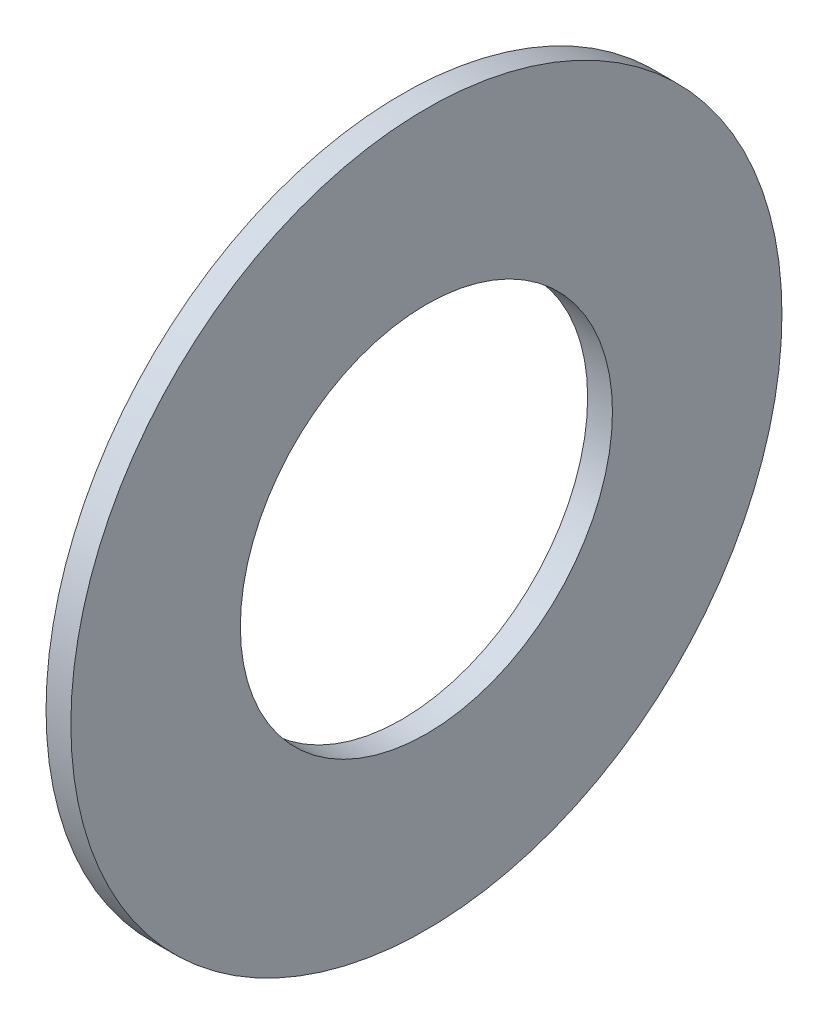
ISO-10303-21;
HEADER;
FILE_DESCRIPTION(('STEP AP214'),'2;1');
FILE_NAME('part.step','',(''),(''),'','','');
FILE_SCHEMA(('AUTOMOTIVE_DESIGN { 1 0 10303 214 1 1 1 1 }'));
ENDSEC;
DATA;
#1=APPLICATION_CONTEXT('core data for automotive mechanical design processes');
#2=APPLICATION_PROTOCOL_DEFINITION('international standard','automotive_design',2000,#1);
#3=PRODUCT_CONTEXT('',#1,'mechanical');
#4=PRODUCT('Part','Part','',(#3));
#5=PRODUCT_RELATED_PRODUCT_CATEGORY('part','',(#4));
#6=PRODUCT_DEFINITION_FORMATION('','',#4);
#7=PRODUCT_DEFINITION_CONTEXT('part definition',#1,'design');
#8=PRODUCT_DEFINITION('design','',#6,#7);
#9=PRODUCT_DEFINITION_SHAPE('','',#8);
#10=(LENGTH_UNIT() NAMED_UNIT(*) SI_UNIT(.MILLI.,.METRE.));
#11=(NAMED_UNIT(*) PLANE_ANGLE_UNIT() SI_UNIT($,.RADIAN.));
#12=(NAMED_UNIT(*) SI_UNIT($,.STERADIAN.) SOLID_ANGLE_UNIT());
#13=UNCERTAINTY_MEASURE_WITH_UNIT(LENGTH_MEASURE(1.E-05),#10,'distance_accuracy_value','');
#14=(GEOMETRIC_REPRESENTATION_CONTEXT(3) GLOBAL_UNCERTAINTY_ASSIGNED_CONTEXT((#13)) GLOBAL_UNIT_ASSIGNED_CONTEXT((#10,
#11,#12)) REPRESENTATION_CONTEXT('',''));
#15=CARTESIAN_POINT('',(0.,0.,0.));
#16=DIRECTION('',(0.,0.,1.));
#17=DIRECTION('',(1.,0.,0.));
#18=AXIS2_PLACEMENT_3D('',#15,#16,#17);
#19=CARTESIAN_POINT('',(-34.5910931282707,40.9061728784586,0.));
#20=DIRECTION('',(1.,0.,0.));
#21=DIRECTION('',(0.,0.,-1.));
#22=AXIS2_PLACEMENT_3D('',#19,#20,#21);
#23=PLANE('',#22);
#24=CARTESIAN_POINT('',(-34.5910931282707,-2.09382712154138,0.));
#25=DIRECTION('',(-1.,0.,0.));
#26=DIRECTION('',(0.,0.,1.));
#27=AXIS2_PLACEMENT_3D('',#24,#25,#26);
#28=CIRCLE('',#27,22.5);
#29=CARTESIAN_POINT('',(-34.5910931282707,-2.09382712154138,22.5));
#30=VERTEX_POINT('',#29);
#31=EDGE_CURVE('E10',#30,#30,#28,.T.);
#32=ORIENTED_EDGE('',*,*,#31,.F.);
#33=EDGE_LOOP('',(#32));
#34=FACE_BOUND('',#33,.T.);
#35=CARTESIAN_POINT('',(-34.5910931282707,-2.09382712154138,0.));
#36=DIRECTION('',(-1.,0.,0.));
#37=DIRECTION('',(0.,0.,1.));
#38=AXIS2_PLACEMENT_3D('',#35,#36,#37);
#39=CIRCLE('',#38,43.);
#40=CARTESIAN_POINT('',(-34.5910931282707,-2.09382712154138,43.));
#41=VERTEX_POINT('',#40);
#42=EDGE_CURVE('E58',#41,#41,#39,.T.);
#43=ORIENTED_EDGE('',*,*,#42,.T.);
#44=EDGE_LOOP('',(#43));
#45=FACE_BOUND('',#44,.T.);
#46=ADVANCED_FACE('F41',(#34,#45),#23,.F.);
#47=CARTESIAN_POINT('',(-20.2626873949071,-2.09382712154138,0.));
#48=DIRECTION('',(-1.,0.,0.));
#49=DIRECTION('',(0.,0.,1.));
#50=AXIS2_PLACEMENT_3D('',#47,#48,#49);
#51=CYLINDRICAL_SURFACE('',#50,22.5);
#52=CARTESIAN_POINT('',(-31.5910931282707,-2.09382712154138,0.));
#53=DIRECTION('',(-1.,0.,0.));
#54=DIRECTION('',(0.,0.,1.));
#55=AXIS2_PLACEMENT_3D('',#52,#53,#54);
#56=CIRCLE('',#55,22.5);
#57=CARTESIAN_POINT('',(-31.5910931282707,-2.09382712154138,22.5));
#58=VERTEX_POINT('',#57);
#59=EDGE_CURVE('E48',#58,#58,#56,.T.);
#60=ORIENTED_EDGE('',*,*,#59,.F.);
#61=EDGE_LOOP('',(#60));
#62=FACE_BOUND('',#61,.T.);
#63=ORIENTED_EDGE('',*,*,#31,.T.);
#64=EDGE_LOOP('',(#63));
#65=FACE_BOUND('',#64,.T.);
#66=ADVANCED_FACE('F74',(#62,#65),#51,.F.);
#67=CARTESIAN_POINT('',(-31.5910931282707,40.9061728784586,0.));
#68=DIRECTION('',(-1.,0.,0.));
#69=DIRECTION('',(0.,0.,1.));
#70=AXIS2_PLACEMENT_3D('',#67,#68,#69);
#71=PLANE('',#70);
#72=CARTESIAN_POINT('',(-31.5910931282707,-2.09382712154138,0.));
#73=DIRECTION('',(-1.,0.,0.));
#74=DIRECTION('',(0.,0.,1.));
#75=AXIS2_PLACEMENT_3D('',#72,#73,#74);
#76=CIRCLE('',#75,43.);
#77=CARTESIAN_POINT('',(-31.5910931282707,-2.09382712154138,43.));
#78=VERTEX_POINT('',#77);
#79=EDGE_CURVE('E53',#78,#78,#76,.T.);
#80=ORIENTED_EDGE('',*,*,#79,.F.);
#81=EDGE_LOOP('',(#80));
#82=FACE_BOUND('',#81,.T.);
#83=ORIENTED_EDGE('',*,*,#59,.T.);
#84=EDGE_LOOP('',(#83));
#85=FACE_BOUND('',#84,.T.);
#86=ADVANCED_FACE('F69',(#82,#85),#71,.F.);
#87=CARTESIAN_POINT('',(-20.2626873949071,-2.09382712154138,0.));
#88=DIRECTION('',(-1.,0.,0.));
#89=DIRECTION('',(0.,0.,1.));
#90=AXIS2_PLACEMENT_3D('',#87,#88,#89);
#91=CYLINDRICAL_SURFACE('',#90,43.);
#92=ORIENTED_EDGE('',*,*,#42,.F.);
#93=EDGE_LOOP('',(#92));
#94=FACE_BOUND('',#93,.T.);
#95=ORIENTED_EDGE('',*,*,#79,.T.);
#96=EDGE_LOOP('',(#95));
#97=FACE_BOUND('',#96,.T.);
#98=ADVANCED_FACE('F66',(#94,#97),#91,.T.);
#99=CLOSED_SHELL('',(#46,#66,#86,#98));
#100=MANIFOLD_SOLID_BREP('B2',#99);
#101=ADVANCED_BREP_SHAPE_REPRESENTATION('',(#18,#100),#14);
#102=SHAPE_DEFINITION_REPRESENTATION(#9,#101);
ENDSEC;
END-ISO-10303-21;
